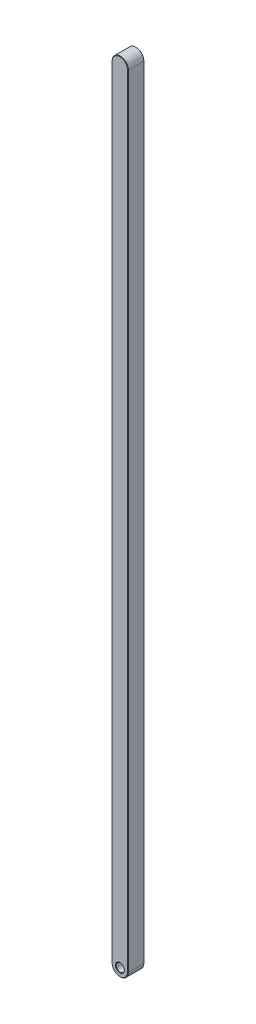
ISO-10303-21;
HEADER;
FILE_DESCRIPTION(('STEP AP214'),'2;1');
FILE_NAME('part.step','',(''),(''),'','','');
FILE_SCHEMA(('AUTOMOTIVE_DESIGN { 1 0 10303 214 1 1 1 1 }'));
ENDSEC;
DATA;
#1=APPLICATION_CONTEXT('core data for automotive mechanical design processes');
#2=APPLICATION_PROTOCOL_DEFINITION('international standard','automotive_design',2000,#1);
#3=PRODUCT_CONTEXT('',#1,'mechanical');
#4=PRODUCT('Part','Part','',(#3));
#5=PRODUCT_RELATED_PRODUCT_CATEGORY('part','',(#4));
#6=PRODUCT_DEFINITION_FORMATION('','',#4);
#7=PRODUCT_DEFINITION_CONTEXT('part definition',#1,'design');
#8=PRODUCT_DEFINITION('design','',#6,#7);
#9=PRODUCT_DEFINITION_SHAPE('','',#8);
#10=(LENGTH_UNIT() NAMED_UNIT(*) SI_UNIT(.MILLI.,.METRE.));
#11=(NAMED_UNIT(*) PLANE_ANGLE_UNIT() SI_UNIT($,.RADIAN.));
#12=(NAMED_UNIT(*) SI_UNIT($,.STERADIAN.) SOLID_ANGLE_UNIT());
#13=UNCERTAINTY_MEASURE_WITH_UNIT(LENGTH_MEASURE(1.E-05),#10,'distance_accuracy_value','');
#14=(GEOMETRIC_REPRESENTATION_CONTEXT(3) GLOBAL_UNCERTAINTY_ASSIGNED_CONTEXT((#13)) GLOBAL_UNIT_ASSIGNED_CONTEXT((#10,
#11,#12)) REPRESENTATION_CONTEXT('',''));
#15=CARTESIAN_POINT('',(0.,0.,0.));
#16=DIRECTION('',(0.,0.,1.));
#17=DIRECTION('',(1.,0.,0.));
#18=AXIS2_PLACEMENT_3D('',#15,#16,#17);
#19=CARTESIAN_POINT('',(0.,0.,4.7625));
#20=DIRECTION('',(0.,0.,1.));
#21=DIRECTION('',(1.,0.,0.));
#22=AXIS2_PLACEMENT_3D('',#19,#20,#21);
#23=PLANE('',#22);
#24=CARTESIAN_POINT('',(0.,0.,4.7625));
#25=DIRECTION('',(0.,0.,1.));
#26=DIRECTION('',(1.,0.,0.));
#27=AXIS2_PLACEMENT_3D('',#24,#25,#26);
#28=CIRCLE('',#27,2.6352500000002);
#29=CARTESIAN_POINT('',(2.6352500000002,0.,4.7625));
#30=VERTEX_POINT('',#29);
#31=EDGE_CURVE('E11',#30,#30,#28,.F.);
#32=ORIENTED_EDGE('',*,*,#31,.T.);
#33=EDGE_LOOP('',(#32));
#34=FACE_BOUND('',#33,.T.);
#35=CARTESIAN_POINT('',(0.,457.2,4.7625));
#36=DIRECTION('',(0.,0.,1.));
#37=DIRECTION('',(1.,0.,0.));
#38=AXIS2_PLACEMENT_3D('',#35,#36,#37);
#39=CIRCLE('',#38,4.50850000000025);
#40=CARTESIAN_POINT('',(4.50850000000025,457.2,4.7625));
#41=VERTEX_POINT('',#40);
#42=CARTESIAN_POINT('',(-4.50850000000025,457.2,4.7625));
#43=VERTEX_POINT('',#42);
#44=EDGE_CURVE('E63',#41,#43,#39,.T.);
#45=ORIENTED_EDGE('',*,*,#44,.T.);
#46=DIRECTION('',(0.,-1.,0.));
#47=VECTOR('',#46,1.);
#48=CARTESIAN_POINT('',(-4.50850000000025,0.,4.7625));
#49=LINE('',#48,#47);
#50=CARTESIAN_POINT('',(-4.50850000000025,0.,4.7625));
#51=VERTEX_POINT('',#50);
#52=EDGE_CURVE('E55',#43,#51,#49,.T.);
#53=ORIENTED_EDGE('',*,*,#52,.T.);
#54=CARTESIAN_POINT('',(0.,0.,4.7625));
#55=DIRECTION('',(0.,0.,1.));
#56=DIRECTION('',(1.,0.,0.));
#57=AXIS2_PLACEMENT_3D('',#54,#55,#56);
#58=CIRCLE('',#57,4.50850000000025);
#59=CARTESIAN_POINT('',(4.50850000000025,0.,4.7625));
#60=VERTEX_POINT('',#59);
#61=EDGE_CURVE('E184',#51,#60,#58,.T.);
#62=ORIENTED_EDGE('',*,*,#61,.T.);
#63=DIRECTION('',(0.,1.,0.));
#64=VECTOR('',#63,1.);
#65=CARTESIAN_POINT('',(4.50850000000025,457.2,4.7625));
#66=LINE('',#65,#64);
#67=EDGE_CURVE('E68',#60,#41,#66,.T.);
#68=ORIENTED_EDGE('',*,*,#67,.T.);
#69=EDGE_LOOP('',(#45,#53,#62,#68));
#70=FACE_BOUND('',#69,.T.);
#71=ADVANCED_FACE('F44',(#34,#70),#23,.T.);
#72=CARTESIAN_POINT('',(0.,0.,-4.7625));
#73=DIRECTION('',(0.,0.,1.));
#74=DIRECTION('',(1.,0.,0.));
#75=AXIS2_PLACEMENT_3D('',#72,#73,#74);
#76=PLANE('',#75);
#77=CARTESIAN_POINT('',(0.,0.,-4.7625));
#78=DIRECTION('',(0.,0.,1.));
#79=DIRECTION('',(1.,0.,0.));
#80=AXIS2_PLACEMENT_3D('',#77,#78,#79);
#81=CIRCLE('',#80,2.63524999999976);
#82=CARTESIAN_POINT('',(2.63524999999976,0.,-4.7625));
#83=VERTEX_POINT('',#82);
#84=EDGE_CURVE('E143',#83,#83,#81,.T.);
#85=ORIENTED_EDGE('',*,*,#84,.T.);
#86=EDGE_LOOP('',(#85));
#87=FACE_BOUND('',#86,.T.);
#88=CARTESIAN_POINT('',(0.,457.2,-4.7625));
#89=DIRECTION('',(0.,0.,1.));
#90=DIRECTION('',(1.,0.,0.));
#91=AXIS2_PLACEMENT_3D('',#88,#89,#90);
#92=CIRCLE('',#91,4.50849999999986);
#93=CARTESIAN_POINT('',(-4.50849999999986,457.2,-4.7625));
#94=VERTEX_POINT('',#93);
#95=CARTESIAN_POINT('',(4.50849999999986,457.2,-4.7625));
#96=VERTEX_POINT('',#95);
#97=EDGE_CURVE('E141',#94,#96,#92,.F.);
#98=ORIENTED_EDGE('',*,*,#97,.T.);
#99=DIRECTION('',(0.,-1.,0.));
#100=VECTOR('',#99,1.);
#101=CARTESIAN_POINT('',(4.50849999999986,0.,-4.7625));
#102=LINE('',#101,#100);
#103=CARTESIAN_POINT('',(4.50849999999986,0.,-4.7625));
#104=VERTEX_POINT('',#103);
#105=EDGE_CURVE('E118',#96,#104,#102,.T.);
#106=ORIENTED_EDGE('',*,*,#105,.T.);
#107=CARTESIAN_POINT('',(0.,0.,-4.7625));
#108=DIRECTION('',(0.,0.,1.));
#109=DIRECTION('',(1.,0.,0.));
#110=AXIS2_PLACEMENT_3D('',#107,#108,#109);
#111=CIRCLE('',#110,4.50849999999986);
#112=CARTESIAN_POINT('',(-4.50849999999986,0.,-4.7625));
#113=VERTEX_POINT('',#112);
#114=EDGE_CURVE('E129',#104,#113,#111,.F.);
#115=ORIENTED_EDGE('',*,*,#114,.T.);
#116=DIRECTION('',(0.,1.,0.));
#117=VECTOR('',#116,1.);
#118=CARTESIAN_POINT('',(-4.50849999999986,0.,-4.7625));
#119=LINE('',#118,#117);
#120=EDGE_CURVE('E136',#113,#94,#119,.T.);
#121=ORIENTED_EDGE('',*,*,#120,.T.);
#122=EDGE_LOOP('',(#98,#106,#115,#121));
#123=FACE_BOUND('',#122,.T.);
#124=ADVANCED_FACE('F139',(#87,#123),#76,.F.);
#125=CARTESIAN_POINT('',(0.,0.,4.7625));
#126=DIRECTION('',(0.,0.,-1.));
#127=DIRECTION('',(-1.,0.,0.));
#128=AXIS2_PLACEMENT_3D('',#125,#126,#127);
#129=CYLINDRICAL_SURFACE('',#128,4.7625);
#130=DIRECTION('',(0.,0.,-1.));
#131=VECTOR('',#130,1.);
#132=CARTESIAN_POINT('',(-4.7625,0.,4.7625));
#133=LINE('',#132,#131);
#134=CARTESIAN_POINT('',(-4.7625,0.,4.50850000000023));
#135=VERTEX_POINT('',#134);
#136=CARTESIAN_POINT('',(-4.7625,0.,-4.50849999999993));
#137=VERTEX_POINT('',#136);
#138=EDGE_CURVE('E200',#135,#137,#133,.T.);
#139=ORIENTED_EDGE('',*,*,#138,.T.);
#140=CARTESIAN_POINT('',(0.,0.,-4.50849999999993));
#141=DIRECTION('',(0.,0.,1.));
#142=DIRECTION('',(1.,0.,0.));
#143=AXIS2_PLACEMENT_3D('',#140,#141,#142);
#144=CIRCLE('',#143,4.7625);
#145=CARTESIAN_POINT('',(4.7625,0.,-4.50849999999993));
#146=VERTEX_POINT('',#145);
#147=EDGE_CURVE('E181',#137,#146,#144,.T.);
#148=ORIENTED_EDGE('',*,*,#147,.T.);
#149=DIRECTION('',(0.,0.,-1.));
#150=VECTOR('',#149,1.);
#151=CARTESIAN_POINT('',(4.7625,0.,4.7625));
#152=LINE('',#151,#150);
#153=CARTESIAN_POINT('',(4.7625,0.,4.50850000000023));
#154=VERTEX_POINT('',#153);
#155=EDGE_CURVE('E137',#154,#146,#152,.T.);
#156=ORIENTED_EDGE('',*,*,#155,.F.);
#157=CARTESIAN_POINT('',(0.,0.,4.50850000000023));
#158=DIRECTION('',(0.,0.,1.));
#159=DIRECTION('',(1.,0.,0.));
#160=AXIS2_PLACEMENT_3D('',#157,#158,#159);
#161=CIRCLE('',#160,4.7625);
#162=EDGE_CURVE('E178',#154,#135,#161,.F.);
#163=ORIENTED_EDGE('',*,*,#162,.T.);
#164=EDGE_LOOP('',(#139,#148,#156,#163));
#165=FACE_BOUND('',#164,.T.);
#166=ADVANCED_FACE('F229',(#165),#129,.T.);
#167=CARTESIAN_POINT('',(4.7625,0.,4.7625));
#168=DIRECTION('',(-1.,0.,0.));
#169=DIRECTION('',(0.,0.,1.));
#170=AXIS2_PLACEMENT_3D('',#167,#168,#169);
#171=PLANE('',#170);
#172=ORIENTED_EDGE('',*,*,#155,.T.);
#173=DIRECTION('',(0.,1.,0.));
#174=VECTOR('',#173,1.);
#175=CARTESIAN_POINT('',(4.7625,0.,-4.50849999999993));
#176=LINE('',#175,#174);
#177=CARTESIAN_POINT('',(4.7625,457.2,-4.50849999999993));
#178=VERTEX_POINT('',#177);
#179=EDGE_CURVE('E121',#146,#178,#176,.T.);
#180=ORIENTED_EDGE('',*,*,#179,.T.);
#181=DIRECTION('',(0.,0.,-1.));
#182=VECTOR('',#181,1.);
#183=CARTESIAN_POINT('',(4.7625,457.2,4.7625));
#184=LINE('',#183,#182);
#185=CARTESIAN_POINT('',(4.7625,457.2,4.50850000000023));
#186=VERTEX_POINT('',#185);
#187=EDGE_CURVE('E226',#186,#178,#184,.T.);
#188=ORIENTED_EDGE('',*,*,#187,.F.);
#189=DIRECTION('',(0.,-1.,0.));
#190=VECTOR('',#189,1.);
#191=CARTESIAN_POINT('',(4.7625,0.,4.50850000000023));
#192=LINE('',#191,#190);
#193=EDGE_CURVE('E160',#186,#154,#192,.T.);
#194=ORIENTED_EDGE('',*,*,#193,.T.);
#195=EDGE_LOOP('',(#172,#180,#188,#194));
#196=FACE_BOUND('',#195,.T.);
#197=ADVANCED_FACE('F224',(#196),#171,.F.);
#198=CARTESIAN_POINT('',(0.,457.2,4.7625));
#199=DIRECTION('',(0.,0.,-1.));
#200=DIRECTION('',(-1.,0.,0.));
#201=AXIS2_PLACEMENT_3D('',#198,#199,#200);
#202=CYLINDRICAL_SURFACE('',#201,4.7625);
#203=ORIENTED_EDGE('',*,*,#187,.T.);
#204=CARTESIAN_POINT('',(0.,457.2,-4.50849999999993));
#205=DIRECTION('',(0.,0.,1.));
#206=DIRECTION('',(1.,0.,0.));
#207=AXIS2_PLACEMENT_3D('',#204,#205,#206);
#208=CIRCLE('',#207,4.7625);
#209=CARTESIAN_POINT('',(-4.7625,457.2,-4.50849999999993));
#210=VERTEX_POINT('',#209);
#211=EDGE_CURVE('E168',#178,#210,#208,.T.);
#212=ORIENTED_EDGE('',*,*,#211,.T.);
#213=DIRECTION('',(0.,0.,-1.));
#214=VECTOR('',#213,1.);
#215=CARTESIAN_POINT('',(-4.7625,457.2,4.7625));
#216=LINE('',#215,#214);
#217=CARTESIAN_POINT('',(-4.7625,457.2,4.50850000000023));
#218=VERTEX_POINT('',#217);
#219=EDGE_CURVE('E234',#218,#210,#216,.T.);
#220=ORIENTED_EDGE('',*,*,#219,.F.);
#221=CARTESIAN_POINT('',(0.,457.2,4.50850000000023));
#222=DIRECTION('',(0.,0.,1.));
#223=DIRECTION('',(1.,0.,0.));
#224=AXIS2_PLACEMENT_3D('',#221,#222,#223);
#225=CIRCLE('',#224,4.7625);
#226=EDGE_CURVE('E165',#218,#186,#225,.F.);
#227=ORIENTED_EDGE('',*,*,#226,.T.);
#228=EDGE_LOOP('',(#203,#212,#220,#227));
#229=FACE_BOUND('',#228,.T.);
#230=ADVANCED_FACE('F248',(#229),#202,.T.);
#231=CARTESIAN_POINT('',(-4.7625,0.,4.7625));
#232=DIRECTION('',(1.,0.,0.));
#233=DIRECTION('',(0.,0.,-1.));
#234=AXIS2_PLACEMENT_3D('',#231,#232,#233);
#235=PLANE('',#234);
#236=ORIENTED_EDGE('',*,*,#219,.T.);
#237=DIRECTION('',(0.,-1.,0.));
#238=VECTOR('',#237,1.);
#239=CARTESIAN_POINT('',(-4.7625,0.,-4.50849999999993));
#240=LINE('',#239,#238);
#241=EDGE_CURVE('E175',#210,#137,#240,.T.);
#242=ORIENTED_EDGE('',*,*,#241,.T.);
#243=ORIENTED_EDGE('',*,*,#138,.F.);
#244=DIRECTION('',(0.,1.,0.));
#245=VECTOR('',#244,1.);
#246=CARTESIAN_POINT('',(-4.7625,457.2,4.50850000000023));
#247=LINE('',#246,#245);
#248=EDGE_CURVE('E171',#135,#218,#247,.T.);
#249=ORIENTED_EDGE('',*,*,#248,.T.);
#250=EDGE_LOOP('',(#236,#242,#243,#249));
#251=FACE_BOUND('',#250,.T.);
#252=ADVANCED_FACE('F254',(#251),#235,.F.);
#253=CARTESIAN_POINT('',(0.,0.,4.7625));
#254=DIRECTION('',(0.,0.,-1.));
#255=DIRECTION('',(-1.,0.,0.));
#256=AXIS2_PLACEMENT_3D('',#253,#254,#255);
#257=CYLINDRICAL_SURFACE('',#256,2.38125);
#258=CARTESIAN_POINT('',(0.,0.,-4.50850000000026));
#259=DIRECTION('',(0.,0.,1.));
#260=DIRECTION('',(1.,0.,0.));
#261=AXIS2_PLACEMENT_3D('',#258,#259,#260);
#262=CIRCLE('',#261,2.38125);
#263=CARTESIAN_POINT('',(2.38125,0.,-4.50850000000026));
#264=VERTEX_POINT('',#263);
#265=EDGE_CURVE('E156',#264,#264,#262,.F.);
#266=ORIENTED_EDGE('',*,*,#265,.T.);
#267=EDGE_LOOP('',(#266));
#268=FACE_BOUND('',#267,.T.);
#269=CARTESIAN_POINT('',(0.,0.,4.50849999999979));
#270=DIRECTION('',(0.,0.,1.));
#271=DIRECTION('',(1.,0.,0.));
#272=AXIS2_PLACEMENT_3D('',#269,#270,#271);
#273=CIRCLE('',#272,2.38125);
#274=CARTESIAN_POINT('',(2.38125,0.,4.50849999999979));
#275=VERTEX_POINT('',#274);
#276=EDGE_CURVE('E148',#275,#275,#273,.T.);
#277=ORIENTED_EDGE('',*,*,#276,.T.);
#278=EDGE_LOOP('',(#277));
#279=FACE_BOUND('',#278,.T.);
#280=ADVANCED_FACE('F269',(#268,#279),#257,.F.);
#281=CARTESIAN_POINT('',(0.,0.,-4.7625));
#282=DIRECTION('',(0.,0.,-1.));
#283=DIRECTION('',(-1.,0.,0.));
#284=AXIS2_PLACEMENT_3D('',#281,#282,#283);
#285=CONICAL_SURFACE('',#284,2.63524999999976,0.785398163397481);
#286=ORIENTED_EDGE('',*,*,#265,.F.);
#287=EDGE_LOOP('',(#286));
#288=FACE_BOUND('',#287,.T.);
#289=ORIENTED_EDGE('',*,*,#84,.F.);
#290=EDGE_LOOP('',(#289));
#291=FACE_BOUND('',#290,.T.);
#292=ADVANCED_FACE('F280',(#288,#291),#285,.F.);
#293=CARTESIAN_POINT('',(-4.7625,0.,-4.50849999999993));
#294=DIRECTION('',(0.707106781186446,0.,0.707106781186649));
#295=DIRECTION('',(0.,-1.,0.));
#296=AXIS2_PLACEMENT_3D('',#293,#294,#295);
#297=PLANE('',#296);
#298=DIRECTION('',(-0.707106781186649,0.,0.707106781186446));
#299=VECTOR('',#298,1.);
#300=CARTESIAN_POINT('',(-4.50849999999986,457.2,-4.7625));
#301=LINE('',#300,#299);
#302=EDGE_CURVE('E125',#94,#210,#301,.T.);
#303=ORIENTED_EDGE('',*,*,#302,.F.);
#304=ORIENTED_EDGE('',*,*,#120,.F.);
#305=DIRECTION('',(0.707106781186649,0.,-0.707106781186446));
#306=VECTOR('',#305,1.);
#307=CARTESIAN_POINT('',(-4.7625,0.,-4.50849999999993));
#308=LINE('',#307,#306);
#309=EDGE_CURVE('E132',#137,#113,#308,.T.);
#310=ORIENTED_EDGE('',*,*,#309,.F.);
#311=ORIENTED_EDGE('',*,*,#241,.F.);
#312=EDGE_LOOP('',(#303,#304,#310,#311));
#313=FACE_BOUND('',#312,.T.);
#314=ADVANCED_FACE('F241',(#313),#297,.F.);
#315=CARTESIAN_POINT('',(0.,0.,-4.50849999999993));
#316=DIRECTION('',(0.,0.,1.));
#317=DIRECTION('',(1.,0.,0.));
#318=AXIS2_PLACEMENT_3D('',#315,#316,#317);
#319=CONICAL_SURFACE('',#318,4.7625,0.785398163397592);
#320=ORIENTED_EDGE('',*,*,#309,.T.);
#321=ORIENTED_EDGE('',*,*,#114,.F.);
#322=DIRECTION('',(-0.707106781186649,0.,-0.707106781186446));
#323=VECTOR('',#322,1.);
#324=CARTESIAN_POINT('',(4.7625,0.,-4.50849999999993));
#325=LINE('',#324,#323);
#326=EDGE_CURVE('E114',#146,#104,#325,.T.);
#327=ORIENTED_EDGE('',*,*,#326,.F.);
#328=ORIENTED_EDGE('',*,*,#147,.F.);
#329=EDGE_LOOP('',(#320,#321,#327,#328));
#330=FACE_BOUND('',#329,.T.);
#331=ADVANCED_FACE('F130',(#330),#319,.T.);
#332=CARTESIAN_POINT('',(0.,457.2,-4.50849999999993));
#333=DIRECTION('',(0.,0.,1.));
#334=DIRECTION('',(1.,0.,0.));
#335=AXIS2_PLACEMENT_3D('',#332,#333,#334);
#336=CONICAL_SURFACE('',#335,4.7625,0.785398163397592);
#337=ORIENTED_EDGE('',*,*,#302,.T.);
#338=ORIENTED_EDGE('',*,*,#211,.F.);
#339=DIRECTION('',(0.707106781186649,0.,0.707106781186446));
#340=VECTOR('',#339,1.);
#341=CARTESIAN_POINT('',(4.50849999999986,457.2,-4.7625));
#342=LINE('',#341,#340);
#343=EDGE_CURVE('E126',#96,#178,#342,.T.);
#344=ORIENTED_EDGE('',*,*,#343,.F.);
#345=ORIENTED_EDGE('',*,*,#97,.F.);
#346=EDGE_LOOP('',(#337,#338,#344,#345));
#347=FACE_BOUND('',#346,.T.);
#348=ADVANCED_FACE('F244',(#347),#336,.T.);
#349=CARTESIAN_POINT('',(4.7625,0.,-4.50849999999993));
#350=DIRECTION('',(-0.707106781186446,0.,0.707106781186649));
#351=DIRECTION('',(0.,1.,0.));
#352=AXIS2_PLACEMENT_3D('',#349,#350,#351);
#353=PLANE('',#352);
#354=ORIENTED_EDGE('',*,*,#326,.T.);
#355=ORIENTED_EDGE('',*,*,#105,.F.);
#356=ORIENTED_EDGE('',*,*,#343,.T.);
#357=ORIENTED_EDGE('',*,*,#179,.F.);
#358=EDGE_LOOP('',(#354,#355,#356,#357));
#359=FACE_BOUND('',#358,.T.);
#360=ADVANCED_FACE('F116',(#359),#353,.F.);
#361=CARTESIAN_POINT('',(0.,0.,4.50849999999979));
#362=DIRECTION('',(0.,0.,1.));
#363=DIRECTION('',(1.,0.,0.));
#364=AXIS2_PLACEMENT_3D('',#361,#362,#363);
#365=CONICAL_SURFACE('',#364,2.38125,0.785398163397431);
#366=ORIENTED_EDGE('',*,*,#31,.F.);
#367=EDGE_LOOP('',(#366));
#368=FACE_BOUND('',#367,.T.);
#369=ORIENTED_EDGE('',*,*,#276,.F.);
#370=EDGE_LOOP('',(#369));
#371=FACE_BOUND('',#370,.T.);
#372=ADVANCED_FACE('F294',(#368,#371),#365,.F.);
#373=CARTESIAN_POINT('',(4.50850000000025,0.,4.7625));
#374=DIRECTION('',(0.707106781186571,0.,0.707106781186525));
#375=DIRECTION('',(0.,-1.,0.));
#376=AXIS2_PLACEMENT_3D('',#373,#374,#375);
#377=PLANE('',#376);
#378=DIRECTION('',(-0.707106781186525,0.,0.707106781186571));
#379=VECTOR('',#378,1.);
#380=CARTESIAN_POINT('',(4.7625,0.,4.50850000000023));
#381=LINE('',#380,#379);
#382=EDGE_CURVE('E206',#154,#60,#381,.T.);
#383=ORIENTED_EDGE('',*,*,#382,.F.);
#384=ORIENTED_EDGE('',*,*,#193,.F.);
#385=DIRECTION('',(0.707106781186525,0.,-0.707106781186571));
#386=VECTOR('',#385,1.);
#387=CARTESIAN_POINT('',(4.50850000000025,457.2,4.7625));
#388=LINE('',#387,#386);
#389=EDGE_CURVE('E49',#41,#186,#388,.T.);
#390=ORIENTED_EDGE('',*,*,#389,.F.);
#391=ORIENTED_EDGE('',*,*,#67,.F.);
#392=EDGE_LOOP('',(#383,#384,#390,#391));
#393=FACE_BOUND('',#392,.T.);
#394=ADVANCED_FACE('F47',(#393),#377,.T.);
#395=CARTESIAN_POINT('',(0.,457.2,4.7625));
#396=DIRECTION('',(0.,0.,-1.));
#397=DIRECTION('',(-1.,0.,0.));
#398=AXIS2_PLACEMENT_3D('',#395,#396,#397);
#399=CONICAL_SURFACE('',#398,4.50850000000025,0.785398163397416);
#400=ORIENTED_EDGE('',*,*,#389,.T.);
#401=ORIENTED_EDGE('',*,*,#226,.F.);
#402=DIRECTION('',(-0.707106781186525,0.,-0.707106781186571));
#403=VECTOR('',#402,1.);
#404=CARTESIAN_POINT('',(-4.50850000000025,457.2,4.7625));
#405=LINE('',#404,#403);
#406=EDGE_CURVE('E204',#43,#218,#405,.T.);
#407=ORIENTED_EDGE('',*,*,#406,.F.);
#408=ORIENTED_EDGE('',*,*,#44,.F.);
#409=EDGE_LOOP('',(#400,#401,#407,#408));
#410=FACE_BOUND('',#409,.T.);
#411=ADVANCED_FACE('F217',(#410),#399,.T.);
#412=CARTESIAN_POINT('',(0.,0.,4.7625));
#413=DIRECTION('',(0.,0.,-1.));
#414=DIRECTION('',(-1.,0.,0.));
#415=AXIS2_PLACEMENT_3D('',#412,#413,#414);
#416=CONICAL_SURFACE('',#415,4.50850000000025,0.785398163397416);
#417=ORIENTED_EDGE('',*,*,#382,.T.);
#418=ORIENTED_EDGE('',*,*,#61,.F.);
#419=DIRECTION('',(0.707106781186525,0.,0.707106781186571));
#420=VECTOR('',#419,1.);
#421=CARTESIAN_POINT('',(-4.7625,0.,4.50850000000023));
#422=LINE('',#421,#420);
#423=EDGE_CURVE('E201',#135,#51,#422,.T.);
#424=ORIENTED_EDGE('',*,*,#423,.F.);
#425=ORIENTED_EDGE('',*,*,#162,.F.);
#426=EDGE_LOOP('',(#417,#418,#424,#425));
#427=FACE_BOUND('',#426,.T.);
#428=ADVANCED_FACE('F259',(#427),#416,.T.);
#429=CARTESIAN_POINT('',(-4.50850000000025,0.,4.7625));
#430=DIRECTION('',(-0.707106781186571,0.,0.707106781186525));
#431=DIRECTION('',(0.,1.,0.));
#432=AXIS2_PLACEMENT_3D('',#429,#430,#431);
#433=PLANE('',#432);
#434=ORIENTED_EDGE('',*,*,#406,.T.);
#435=ORIENTED_EDGE('',*,*,#248,.F.);
#436=ORIENTED_EDGE('',*,*,#423,.T.);
#437=ORIENTED_EDGE('',*,*,#52,.F.);
#438=EDGE_LOOP('',(#434,#435,#436,#437));
#439=FACE_BOUND('',#438,.T.);
#440=ADVANCED_FACE('F257',(#439),#433,.T.);
#441=CLOSED_SHELL('',(#71,#124,#166,#197,#230,#252,#280,#292,#314,#331,#348,#360,#372,#394,#411,
#428,#440));
#442=MANIFOLD_SOLID_BREP('B2',#441);
#443=ADVANCED_BREP_SHAPE_REPRESENTATION('',(#18,#442),#14);
#444=SHAPE_DEFINITION_REPRESENTATION(#9,#443);
ENDSEC;
END-ISO-10303-21;
